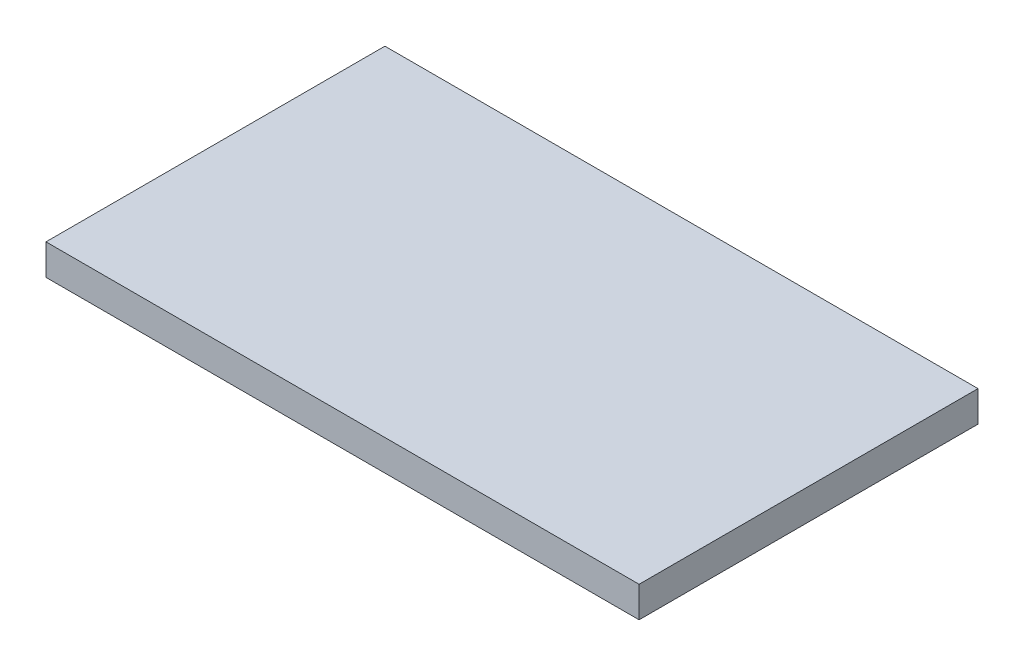
ISO-10303-21;
HEADER;
FILE_DESCRIPTION(('STEP AP214'),'2;1');
FILE_NAME('part.step','',(''),(''),'','','');
FILE_SCHEMA(('AUTOMOTIVE_DESIGN { 1 0 10303 214 1 1 1 1 }'));
ENDSEC;
DATA;
#1=APPLICATION_CONTEXT('core data for automotive mechanical design processes');
#2=APPLICATION_PROTOCOL_DEFINITION('international standard','automotive_design',2000,#1);
#3=PRODUCT_CONTEXT('',#1,'mechanical');
#4=PRODUCT('Part','Part','',(#3));
#5=PRODUCT_RELATED_PRODUCT_CATEGORY('part','',(#4));
#6=PRODUCT_DEFINITION_FORMATION('','',#4);
#7=PRODUCT_DEFINITION_CONTEXT('part definition',#1,'design');
#8=PRODUCT_DEFINITION('design','',#6,#7);
#9=PRODUCT_DEFINITION_SHAPE('','',#8);
#10=(LENGTH_UNIT() NAMED_UNIT(*) SI_UNIT(.MILLI.,.METRE.));
#11=(NAMED_UNIT(*) PLANE_ANGLE_UNIT() SI_UNIT($,.RADIAN.));
#12=(NAMED_UNIT(*) SI_UNIT($,.STERADIAN.) SOLID_ANGLE_UNIT());
#13=UNCERTAINTY_MEASURE_WITH_UNIT(LENGTH_MEASURE(1.E-05),#10,'distance_accuracy_value','');
#14=(GEOMETRIC_REPRESENTATION_CONTEXT(3) GLOBAL_UNCERTAINTY_ASSIGNED_CONTEXT((#13)) GLOBAL_UNIT_ASSIGNED_CONTEXT((#10,
#11,#12)) REPRESENTATION_CONTEXT('',''));
#15=CARTESIAN_POINT('',(0.,0.,0.));
#16=DIRECTION('',(0.,0.,1.));
#17=DIRECTION('',(1.,0.,0.));
#18=AXIS2_PLACEMENT_3D('',#15,#16,#17);
#19=CARTESIAN_POINT('',(19.25,2.,11.));
#20=DIRECTION('',(-1.,0.,0.));
#21=DIRECTION('',(0.,0.,1.));
#22=AXIS2_PLACEMENT_3D('',#19,#20,#21);
#23=PLANE('',#22);
#24=DIRECTION('',(0.,0.,-1.));
#25=VECTOR('',#24,1.);
#26=CARTESIAN_POINT('',(19.25,0.,11.));
#27=LINE('',#26,#25);
#28=CARTESIAN_POINT('',(19.25,0.,11.));
#29=VERTEX_POINT('',#28);
#30=CARTESIAN_POINT('',(19.25,0.,-11.));
#31=VERTEX_POINT('',#30);
#32=EDGE_CURVE('E96',#29,#31,#27,.T.);
#33=ORIENTED_EDGE('',*,*,#32,.T.);
#34=DIRECTION('',(0.,-1.,0.));
#35=VECTOR('',#34,1.);
#36=CARTESIAN_POINT('',(19.25,2.,-11.));
#37=LINE('',#36,#35);
#38=CARTESIAN_POINT('',(19.25,2.,-11.));
#39=VERTEX_POINT('',#38);
#40=EDGE_CURVE('E11',#39,#31,#37,.T.);
#41=ORIENTED_EDGE('',*,*,#40,.F.);
#42=DIRECTION('',(0.,0.,-1.));
#43=VECTOR('',#42,1.);
#44=CARTESIAN_POINT('',(19.25,2.,11.));
#45=LINE('',#44,#43);
#46=CARTESIAN_POINT('',(19.25,2.,11.));
#47=VERTEX_POINT('',#46);
#48=EDGE_CURVE('E84',#47,#39,#45,.T.);
#49=ORIENTED_EDGE('',*,*,#48,.F.);
#50=DIRECTION('',(0.,-1.,0.));
#51=VECTOR('',#50,1.);
#52=CARTESIAN_POINT('',(19.25,2.,11.));
#53=LINE('',#52,#51);
#54=EDGE_CURVE('E92',#47,#29,#53,.T.);
#55=ORIENTED_EDGE('',*,*,#54,.T.);
#56=EDGE_LOOP('',(#33,#41,#49,#55));
#57=FACE_BOUND('',#56,.T.);
#58=ADVANCED_FACE('F33',(#57),#23,.F.);
#59=CARTESIAN_POINT('',(-19.25,2.,-11.));
#60=DIRECTION('',(0.,0.,1.));
#61=DIRECTION('',(1.,0.,0.));
#62=AXIS2_PLACEMENT_3D('',#59,#60,#61);
#63=PLANE('',#62);
#64=DIRECTION('',(-1.,0.,0.));
#65=VECTOR('',#64,1.);
#66=CARTESIAN_POINT('',(-19.25,0.,-11.));
#67=LINE('',#66,#65);
#68=CARTESIAN_POINT('',(-19.25,0.,-11.));
#69=VERTEX_POINT('',#68);
#70=EDGE_CURVE('E88',#31,#69,#67,.T.);
#71=ORIENTED_EDGE('',*,*,#70,.T.);
#72=DIRECTION('',(0.,-1.,0.));
#73=VECTOR('',#72,1.);
#74=CARTESIAN_POINT('',(-19.25,2.,-11.));
#75=LINE('',#74,#73);
#76=CARTESIAN_POINT('',(-19.25,2.,-11.));
#77=VERTEX_POINT('',#76);
#78=EDGE_CURVE('E41',#77,#69,#75,.T.);
#79=ORIENTED_EDGE('',*,*,#78,.F.);
#80=DIRECTION('',(-1.,0.,0.));
#81=VECTOR('',#80,1.);
#82=CARTESIAN_POINT('',(-19.25,2.,-11.));
#83=LINE('',#82,#81);
#84=EDGE_CURVE('E79',#39,#77,#83,.T.);
#85=ORIENTED_EDGE('',*,*,#84,.F.);
#86=ORIENTED_EDGE('',*,*,#40,.T.);
#87=EDGE_LOOP('',(#71,#79,#85,#86));
#88=FACE_BOUND('',#87,.T.);
#89=ADVANCED_FACE('F87',(#88),#63,.F.);
#90=CARTESIAN_POINT('',(-19.25,2.,11.));
#91=DIRECTION('',(1.,0.,0.));
#92=DIRECTION('',(0.,0.,-1.));
#93=AXIS2_PLACEMENT_3D('',#90,#91,#92);
#94=PLANE('',#93);
#95=DIRECTION('',(0.,0.,1.));
#96=VECTOR('',#95,1.);
#97=CARTESIAN_POINT('',(-19.25,0.,11.));
#98=LINE('',#97,#96);
#99=CARTESIAN_POINT('',(-19.25,0.,11.));
#100=VERTEX_POINT('',#99);
#101=EDGE_CURVE('E66',#69,#100,#98,.T.);
#102=ORIENTED_EDGE('',*,*,#101,.T.);
#103=DIRECTION('',(0.,-1.,0.));
#104=VECTOR('',#103,1.);
#105=CARTESIAN_POINT('',(-19.25,2.,11.));
#106=LINE('',#105,#104);
#107=CARTESIAN_POINT('',(-19.25,2.,11.));
#108=VERTEX_POINT('',#107);
#109=EDGE_CURVE('E89',#108,#100,#106,.T.);
#110=ORIENTED_EDGE('',*,*,#109,.F.);
#111=DIRECTION('',(0.,0.,1.));
#112=VECTOR('',#111,1.);
#113=CARTESIAN_POINT('',(-19.25,2.,11.));
#114=LINE('',#113,#112);
#115=EDGE_CURVE('E82',#77,#108,#114,.T.);
#116=ORIENTED_EDGE('',*,*,#115,.F.);
#117=ORIENTED_EDGE('',*,*,#78,.T.);
#118=EDGE_LOOP('',(#102,#110,#116,#117));
#119=FACE_BOUND('',#118,.T.);
#120=ADVANCED_FACE('F90',(#119),#94,.F.);
#121=CARTESIAN_POINT('',(-19.25,2.,11.));
#122=DIRECTION('',(0.,0.,-1.));
#123=DIRECTION('',(-1.,0.,0.));
#124=AXIS2_PLACEMENT_3D('',#121,#122,#123);
#125=PLANE('',#124);
#126=DIRECTION('',(1.,0.,0.));
#127=VECTOR('',#126,1.);
#128=CARTESIAN_POINT('',(-19.25,0.,11.));
#129=LINE('',#128,#127);
#130=EDGE_CURVE('E72',#100,#29,#129,.T.);
#131=ORIENTED_EDGE('',*,*,#130,.T.);
#132=ORIENTED_EDGE('',*,*,#54,.F.);
#133=DIRECTION('',(1.,0.,0.));
#134=VECTOR('',#133,1.);
#135=CARTESIAN_POINT('',(-19.25,2.,11.));
#136=LINE('',#135,#134);
#137=EDGE_CURVE('E49',#108,#47,#136,.T.);
#138=ORIENTED_EDGE('',*,*,#137,.F.);
#139=ORIENTED_EDGE('',*,*,#109,.T.);
#140=EDGE_LOOP('',(#131,#132,#138,#139));
#141=FACE_BOUND('',#140,.T.);
#142=ADVANCED_FACE('F103',(#141),#125,.F.);
#143=CARTESIAN_POINT('',(0.,2.,0.));
#144=DIRECTION('',(0.,-1.,0.));
#145=DIRECTION('',(0.,0.,-1.));
#146=AXIS2_PLACEMENT_3D('',#143,#144,#145);
#147=PLANE('',#146);
#148=ORIENTED_EDGE('',*,*,#48,.T.);
#149=ORIENTED_EDGE('',*,*,#84,.T.);
#150=ORIENTED_EDGE('',*,*,#115,.T.);
#151=ORIENTED_EDGE('',*,*,#137,.T.);
#152=EDGE_LOOP('',(#148,#149,#150,#151));
#153=FACE_BOUND('',#152,.T.);
#154=ADVANCED_FACE('F80',(#153),#147,.F.);
#155=CARTESIAN_POINT('',(0.,0.,0.));
#156=DIRECTION('',(0.,-1.,0.));
#157=DIRECTION('',(0.,0.,-1.));
#158=AXIS2_PLACEMENT_3D('',#155,#156,#157);
#159=PLANE('',#158);
#160=ORIENTED_EDGE('',*,*,#32,.F.);
#161=ORIENTED_EDGE('',*,*,#130,.F.);
#162=ORIENTED_EDGE('',*,*,#101,.F.);
#163=ORIENTED_EDGE('',*,*,#70,.F.);
#164=EDGE_LOOP('',(#160,#161,#162,#163));
#165=FACE_BOUND('',#164,.T.);
#166=ADVANCED_FACE('F106',(#165),#159,.T.);
#167=CLOSED_SHELL('',(#58,#89,#120,#142,#154,#166));
#168=MANIFOLD_SOLID_BREP('B2',#167);
#169=ADVANCED_BREP_SHAPE_REPRESENTATION('',(#18,#168),#14);
#170=SHAPE_DEFINITION_REPRESENTATION(#9,#169);
ENDSEC;
END-ISO-10303-21;
